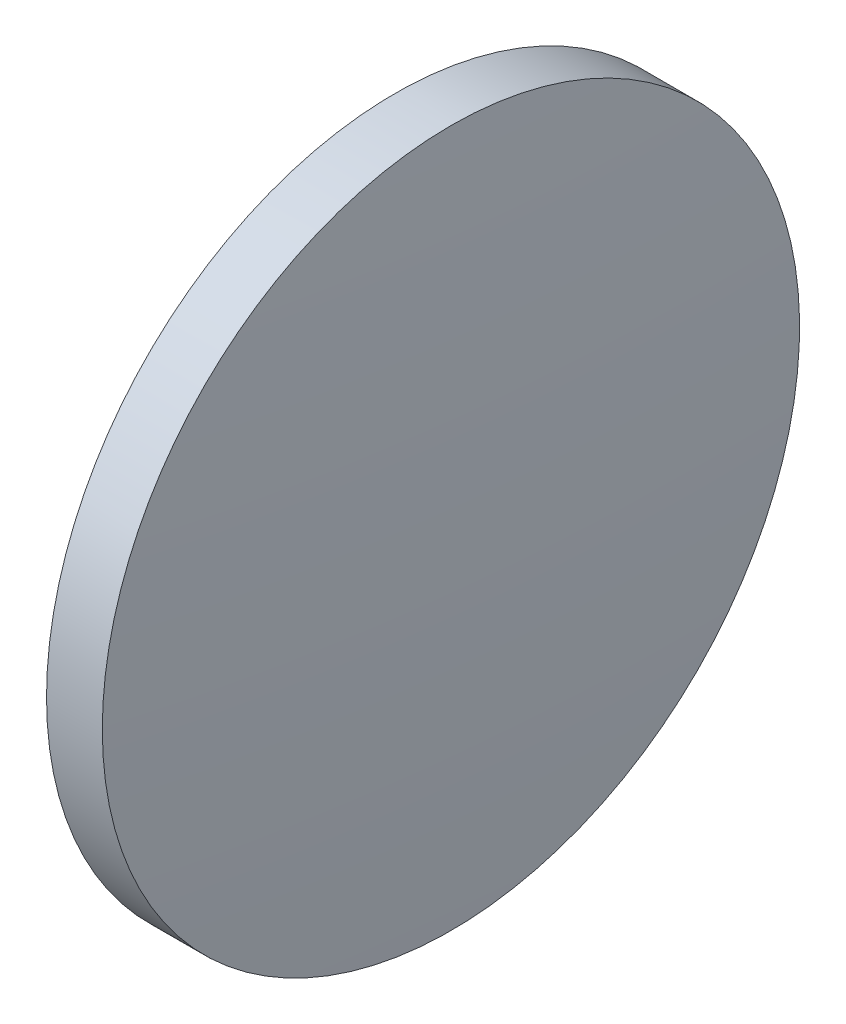
ISO-10303-21;
HEADER;
FILE_DESCRIPTION(('STEP AP214'),'2;1');
FILE_NAME('part.step','',(''),(''),'','','');
FILE_SCHEMA(('AUTOMOTIVE_DESIGN { 1 0 10303 214 1 1 1 1 }'));
ENDSEC;
DATA;
#1=APPLICATION_CONTEXT('core data for automotive mechanical design processes');
#2=APPLICATION_PROTOCOL_DEFINITION('international standard','automotive_design',2000,#1);
#3=PRODUCT_CONTEXT('',#1,'mechanical');
#4=PRODUCT('Part','Part','',(#3));
#5=PRODUCT_RELATED_PRODUCT_CATEGORY('part','',(#4));
#6=PRODUCT_DEFINITION_FORMATION('','',#4);
#7=PRODUCT_DEFINITION_CONTEXT('part definition',#1,'design');
#8=PRODUCT_DEFINITION('design','',#6,#7);
#9=PRODUCT_DEFINITION_SHAPE('','',#8);
#10=(LENGTH_UNIT() NAMED_UNIT(*) SI_UNIT(.MILLI.,.METRE.));
#11=(NAMED_UNIT(*) PLANE_ANGLE_UNIT() SI_UNIT($,.RADIAN.));
#12=(NAMED_UNIT(*) SI_UNIT($,.STERADIAN.) SOLID_ANGLE_UNIT());
#13=UNCERTAINTY_MEASURE_WITH_UNIT(LENGTH_MEASURE(1.E-05),#10,'distance_accuracy_value','');
#14=(GEOMETRIC_REPRESENTATION_CONTEXT(3) GLOBAL_UNCERTAINTY_ASSIGNED_CONTEXT((#13)) GLOBAL_UNIT_ASSIGNED_CONTEXT((#10,
#11,#12)) REPRESENTATION_CONTEXT('',''));
#15=CARTESIAN_POINT('',(0.,0.,0.));
#16=DIRECTION('',(0.,0.,1.));
#17=DIRECTION('',(1.,0.,0.));
#18=AXIS2_PLACEMENT_3D('',#15,#16,#17);
#19=CARTESIAN_POINT('',(175.892570186586,209.041396646408,0.));
#20=DIRECTION('',(-1.,0.,0.));
#21=DIRECTION('',(0.,1.,0.));
#22=AXIS2_PLACEMENT_3D('',#19,#20,#21);
#23=SPHERICAL_SURFACE('',#22,205.782105263157);
#24=CARTESIAN_POINT('',(381.294675449742,209.041396646408,0.));
#25=DIRECTION('',(-1.,0.,0.));
#26=DIRECTION('',(0.,0.,1.));
#27=AXIS2_PLACEMENT_3D('',#24,#25,#26);
#28=CIRCLE('',#27,12.5);
#29=CARTESIAN_POINT('',(381.294675449742,209.041396646408,12.5));
#30=VERTEX_POINT('',#29);
#31=EDGE_CURVE('E10',#30,#30,#28,.T.);
#32=ORIENTED_EDGE('',*,*,#31,.F.);
#33=EDGE_LOOP('',(#32));
#34=FACE_BOUND('',#33,.T.);
#35=ADVANCED_FACE('F35',(#34),#23,.T.);
#36=CARTESIAN_POINT('',(376.929059546981,209.041396646408,0.));
#37=DIRECTION('',(-1.,0.,0.));
#38=DIRECTION('',(0.,0.,1.));
#39=AXIS2_PLACEMENT_3D('',#36,#37,#38);
#40=CYLINDRICAL_SURFACE('',#39,12.5);
#41=CARTESIAN_POINT('',(379.294675449742,209.041396646408,0.));
#42=DIRECTION('',(-1.,0.,0.));
#43=DIRECTION('',(0.,0.,1.));
#44=AXIS2_PLACEMENT_3D('',#41,#42,#43);
#45=CIRCLE('',#44,12.5);
#46=CARTESIAN_POINT('',(379.294675449742,209.041396646408,12.5));
#47=VERTEX_POINT('',#46);
#48=EDGE_CURVE('E41',#47,#47,#45,.T.);
#49=ORIENTED_EDGE('',*,*,#48,.F.);
#50=EDGE_LOOP('',(#49));
#51=FACE_BOUND('',#50,.T.);
#52=ORIENTED_EDGE('',*,*,#31,.T.);
#53=EDGE_LOOP('',(#52));
#54=FACE_BOUND('',#53,.T.);
#55=ADVANCED_FACE('F49',(#51,#54),#40,.T.);
#56=CARTESIAN_POINT('',(379.294675449742,209.041396646408,0.));
#57=DIRECTION('',(1.,0.,0.));
#58=DIRECTION('',(0.,0.,-1.));
#59=AXIS2_PLACEMENT_3D('',#56,#57,#58);
#60=PLANE('',#59);
#61=ORIENTED_EDGE('',*,*,#48,.T.);
#62=EDGE_LOOP('',(#61));
#63=FACE_BOUND('',#62,.T.);
#64=ADVANCED_FACE('F47',(#63),#60,.F.);
#65=CLOSED_SHELL('',(#35,#55,#64));
#66=MANIFOLD_SOLID_BREP('B2',#65);
#67=ADVANCED_BREP_SHAPE_REPRESENTATION('',(#18,#66),#14);
#68=SHAPE_DEFINITION_REPRESENTATION(#9,#67);
ENDSEC;
END-ISO-10303-21;
